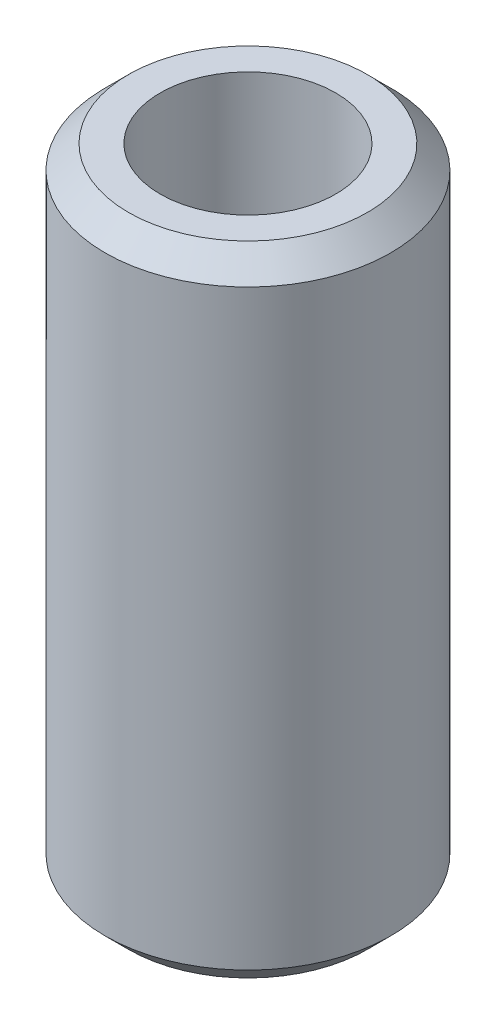
ISO-10303-21;
HEADER;
FILE_DESCRIPTION(('STEP AP214'),'2;1');
FILE_NAME('part.step','',(''),(''),'','','');
FILE_SCHEMA(('AUTOMOTIVE_DESIGN { 1 0 10303 214 1 1 1 1 }'));
ENDSEC;
DATA;
#1=APPLICATION_CONTEXT('core data for automotive mechanical design processes');
#2=APPLICATION_PROTOCOL_DEFINITION('international standard','automotive_design',2000,#1);
#3=PRODUCT_CONTEXT('',#1,'mechanical');
#4=PRODUCT('Part','Part','',(#3));
#5=PRODUCT_RELATED_PRODUCT_CATEGORY('part','',(#4));
#6=PRODUCT_DEFINITION_FORMATION('','',#4);
#7=PRODUCT_DEFINITION_CONTEXT('part definition',#1,'design');
#8=PRODUCT_DEFINITION('design','',#6,#7);
#9=PRODUCT_DEFINITION_SHAPE('','',#8);
#10=(LENGTH_UNIT() NAMED_UNIT(*) SI_UNIT(.MILLI.,.METRE.));
#11=(NAMED_UNIT(*) PLANE_ANGLE_UNIT() SI_UNIT($,.RADIAN.));
#12=(NAMED_UNIT(*) SI_UNIT($,.STERADIAN.) SOLID_ANGLE_UNIT());
#13=UNCERTAINTY_MEASURE_WITH_UNIT(LENGTH_MEASURE(1.E-05),#10,'distance_accuracy_value','');
#14=(GEOMETRIC_REPRESENTATION_CONTEXT(3) GLOBAL_UNCERTAINTY_ASSIGNED_CONTEXT((#13)) GLOBAL_UNIT_ASSIGNED_CONTEXT((#10,
#11,#12)) REPRESENTATION_CONTEXT('',''));
#15=CARTESIAN_POINT('',(0.,0.,0.));
#16=DIRECTION('',(0.,0.,1.));
#17=DIRECTION('',(1.,0.,0.));
#18=AXIS2_PLACEMENT_3D('',#15,#16,#17);
#19=CARTESIAN_POINT('',(0.,134.065661057585,0.));
#20=DIRECTION('',(0.,-1.,0.));
#21=DIRECTION('',(0.,0.,-1.));
#22=AXIS2_PLACEMENT_3D('',#19,#20,#21);
#23=CYLINDRICAL_SURFACE('',#22,30.);
#24=CARTESIAN_POINT('',(0.,129.163662736502,0.));
#25=DIRECTION('',(0.,1.,0.));
#26=DIRECTION('',(0.,0.,1.));
#27=AXIS2_PLACEMENT_3D('',#24,#25,#26);
#28=CIRCLE('',#27,30.);
#29=CARTESIAN_POINT('',(0.,129.163662736502,30.));
#30=VERTEX_POINT('',#29);
#31=EDGE_CURVE('E50',#30,#30,#28,.F.);
#32=ORIENTED_EDGE('',*,*,#31,.T.);
#33=EDGE_LOOP('',(#32));
#34=FACE_BOUND('',#33,.T.);
#35=CARTESIAN_POINT('',(0.,4.9019983210826,0.));
#36=DIRECTION('',(0.,1.,0.));
#37=DIRECTION('',(0.,0.,1.));
#38=AXIS2_PLACEMENT_3D('',#35,#36,#37);
#39=CIRCLE('',#38,30.);
#40=CARTESIAN_POINT('',(0.,4.9019983210826,30.));
#41=VERTEX_POINT('',#40);
#42=EDGE_CURVE('E51',#41,#41,#39,.T.);
#43=ORIENTED_EDGE('',*,*,#42,.T.);
#44=EDGE_LOOP('',(#43));
#45=FACE_BOUND('',#44,.T.);
#46=ADVANCED_FACE('F39',(#34,#45),#23,.T.);
#47=CARTESIAN_POINT('',(0.,134.065661057585,0.));
#48=DIRECTION('',(0.,1.,0.));
#49=DIRECTION('',(0.,0.,1.));
#50=AXIS2_PLACEMENT_3D('',#47,#48,#49);
#51=PLANE('',#50);
#52=CARTESIAN_POINT('',(0.,134.065661057585,0.));
#53=DIRECTION('',(0.,1.,0.));
#54=DIRECTION('',(0.,0.,1.));
#55=AXIS2_PLACEMENT_3D('',#52,#53,#54);
#56=CIRCLE('',#55,25.0980016789175);
#57=CARTESIAN_POINT('',(0.,134.065661057585,25.0980016789175));
#58=VERTEX_POINT('',#57);
#59=EDGE_CURVE('E54',#58,#58,#56,.T.);
#60=ORIENTED_EDGE('',*,*,#59,.T.);
#61=EDGE_LOOP('',(#60));
#62=FACE_BOUND('',#61,.T.);
#63=CARTESIAN_POINT('',(0.,134.065661057585,0.));
#64=DIRECTION('',(0.,1.,0.));
#65=DIRECTION('',(0.,0.,1.));
#66=AXIS2_PLACEMENT_3D('',#63,#64,#65);
#67=CIRCLE('',#66,18.4315547263588);
#68=CARTESIAN_POINT('',(0.,134.065661057585,18.4315547263588));
#69=VERTEX_POINT('',#68);
#70=EDGE_CURVE('E58',#69,#69,#67,.T.);
#71=ORIENTED_EDGE('',*,*,#70,.F.);
#72=EDGE_LOOP('',(#71));
#73=FACE_BOUND('',#72,.T.);
#74=ADVANCED_FACE('F69',(#62,#73),#51,.T.);
#75=CARTESIAN_POINT('',(0.,0.,0.));
#76=DIRECTION('',(0.,1.,0.));
#77=DIRECTION('',(0.,0.,1.));
#78=AXIS2_PLACEMENT_3D('',#75,#76,#77);
#79=PLANE('',#78);
#80=CARTESIAN_POINT('',(0.,0.,0.));
#81=DIRECTION('',(0.,1.,0.));
#82=DIRECTION('',(0.,0.,1.));
#83=AXIS2_PLACEMENT_3D('',#80,#81,#82);
#84=CIRCLE('',#83,25.0980016789174);
#85=CARTESIAN_POINT('',(0.,0.,25.0980016789174));
#86=VERTEX_POINT('',#85);
#87=EDGE_CURVE('E10',#86,#86,#84,.F.);
#88=ORIENTED_EDGE('',*,*,#87,.T.);
#89=EDGE_LOOP('',(#88));
#90=FACE_BOUND('',#89,.T.);
#91=CARTESIAN_POINT('',(0.,0.,0.));
#92=DIRECTION('',(0.,1.,0.));
#93=DIRECTION('',(0.,0.,1.));
#94=AXIS2_PLACEMENT_3D('',#91,#92,#93);
#95=CIRCLE('',#94,18.4315547263588);
#96=CARTESIAN_POINT('',(0.,0.,18.4315547263588));
#97=VERTEX_POINT('',#96);
#98=EDGE_CURVE('E63',#97,#97,#95,.T.);
#99=ORIENTED_EDGE('',*,*,#98,.T.);
#100=EDGE_LOOP('',(#99));
#101=FACE_BOUND('',#100,.T.);
#102=ADVANCED_FACE('F75',(#90,#101),#79,.F.);
#103=CARTESIAN_POINT('',(0.,134.065661057585,0.));
#104=DIRECTION('',(0.,-1.,0.));
#105=DIRECTION('',(0.,0.,-1.));
#106=AXIS2_PLACEMENT_3D('',#103,#104,#105);
#107=CYLINDRICAL_SURFACE('',#106,18.4315547263588);
#108=ORIENTED_EDGE('',*,*,#70,.T.);
#109=EDGE_LOOP('',(#108));
#110=FACE_BOUND('',#109,.T.);
#111=ORIENTED_EDGE('',*,*,#98,.F.);
#112=EDGE_LOOP('',(#111));
#113=FACE_BOUND('',#112,.T.);
#114=ADVANCED_FACE('F70',(#110,#113),#107,.F.);
#115=CARTESIAN_POINT('',(0.,134.065661057585,0.));
#116=DIRECTION('',(0.,-1.,0.));
#117=DIRECTION('',(0.,0.,-1.));
#118=AXIS2_PLACEMENT_3D('',#115,#116,#117);
#119=CONICAL_SURFACE('',#118,25.0980016789175,0.785398163397446);
#120=ORIENTED_EDGE('',*,*,#31,.F.);
#121=EDGE_LOOP('',(#120));
#122=FACE_BOUND('',#121,.T.);
#123=ORIENTED_EDGE('',*,*,#59,.F.);
#124=EDGE_LOOP('',(#123));
#125=FACE_BOUND('',#124,.T.);
#126=ADVANCED_FACE('F81',(#122,#125),#119,.T.);
#127=CARTESIAN_POINT('',(0.,4.9019983210826,0.));
#128=DIRECTION('',(0.,1.,0.));
#129=DIRECTION('',(0.,0.,1.));
#130=AXIS2_PLACEMENT_3D('',#127,#128,#129);
#131=CONICAL_SURFACE('',#130,30.,0.785398163397451);
#132=ORIENTED_EDGE('',*,*,#87,.F.);
#133=EDGE_LOOP('',(#132));
#134=FACE_BOUND('',#133,.T.);
#135=ORIENTED_EDGE('',*,*,#42,.F.);
#136=EDGE_LOOP('',(#135));
#137=FACE_BOUND('',#136,.T.);
#138=ADVANCED_FACE('F45',(#134,#137),#131,.T.);
#139=CLOSED_SHELL('',(#46,#74,#102,#114,#126,#138));
#140=MANIFOLD_SOLID_BREP('B2',#139);
#141=ADVANCED_BREP_SHAPE_REPRESENTATION('',(#18,#140),#14);
#142=SHAPE_DEFINITION_REPRESENTATION(#9,#141);
ENDSEC;
END-ISO-10303-21;
